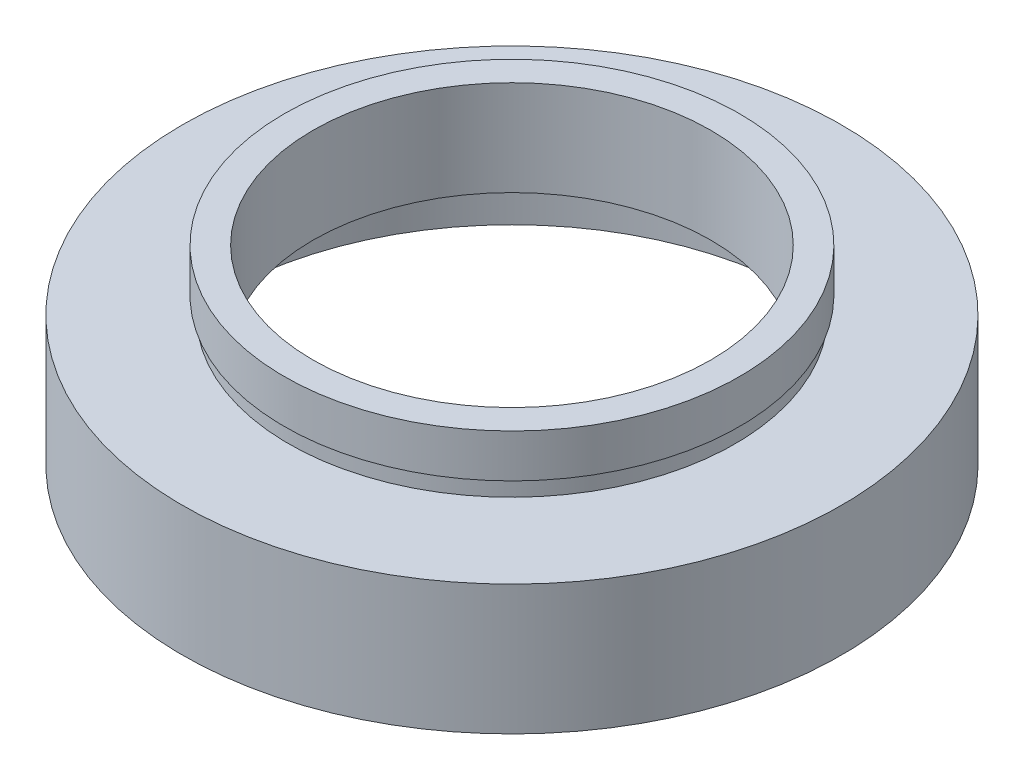
ISO-10303-21;
HEADER;
FILE_DESCRIPTION(('STEP AP214'),'2;1');
FILE_NAME('part.step','',(''),(''),'','','');
FILE_SCHEMA(('AUTOMOTIVE_DESIGN { 1 0 10303 214 1 1 1 1 }'));
ENDSEC;
DATA;
#1=APPLICATION_CONTEXT('core data for automotive mechanical design processes');
#2=APPLICATION_PROTOCOL_DEFINITION('international standard','automotive_design',2000,#1);
#3=PRODUCT_CONTEXT('',#1,'mechanical');
#4=PRODUCT('Part','Part','',(#3));
#5=PRODUCT_RELATED_PRODUCT_CATEGORY('part','',(#4));
#6=PRODUCT_DEFINITION_FORMATION('','',#4);
#7=PRODUCT_DEFINITION_CONTEXT('part definition',#1,'design');
#8=PRODUCT_DEFINITION('design','',#6,#7);
#9=PRODUCT_DEFINITION_SHAPE('','',#8);
#10=(LENGTH_UNIT() NAMED_UNIT(*) SI_UNIT(.MILLI.,.METRE.));
#11=(NAMED_UNIT(*) PLANE_ANGLE_UNIT() SI_UNIT($,.RADIAN.));
#12=(NAMED_UNIT(*) SI_UNIT($,.STERADIAN.) SOLID_ANGLE_UNIT());
#13=UNCERTAINTY_MEASURE_WITH_UNIT(LENGTH_MEASURE(1.E-05),#10,'distance_accuracy_value','');
#14=(GEOMETRIC_REPRESENTATION_CONTEXT(3) GLOBAL_UNCERTAINTY_ASSIGNED_CONTEXT((#13)) GLOBAL_UNIT_ASSIGNED_CONTEXT((#10,
#11,#12)) REPRESENTATION_CONTEXT('',''));
#15=CARTESIAN_POINT('',(0.,0.,0.));
#16=DIRECTION('',(0.,0.,1.));
#17=DIRECTION('',(1.,0.,0.));
#18=AXIS2_PLACEMENT_3D('',#15,#16,#17);
#19=CARTESIAN_POINT('',(19.05,0.,0.));
#20=DIRECTION('',(0.,1.,0.));
#21=DIRECTION('',(-1.,0.,0.));
#22=AXIS2_PLACEMENT_3D('',#19,#20,#21);
#23=PLANE('',#22);
#24=CARTESIAN_POINT('',(0.,0.,0.));
#25=DIRECTION('',(0.,1.,0.));
#26=DIRECTION('',(-1.,0.,0.));
#27=AXIS2_PLACEMENT_3D('',#24,#25,#26);
#28=CIRCLE('',#27,19.05);
#29=CARTESIAN_POINT('',(-19.05,0.,0.));
#30=VERTEX_POINT('',#29);
#31=EDGE_CURVE('E75',#30,#30,#28,.T.);
#32=ORIENTED_EDGE('',*,*,#31,.F.);
#33=EDGE_LOOP('',(#32));
#34=FACE_BOUND('',#33,.T.);
#35=CARTESIAN_POINT('',(0.,0.,0.));
#36=DIRECTION('',(0.,1.,0.));
#37=DIRECTION('',(-1.,0.,0.));
#38=AXIS2_PLACEMENT_3D('',#35,#36,#37);
#39=CIRCLE('',#38,17.);
#40=CARTESIAN_POINT('',(-17.,0.,0.));
#41=VERTEX_POINT('',#40);
#42=EDGE_CURVE('E10',#41,#41,#39,.T.);
#43=ORIENTED_EDGE('',*,*,#42,.T.);
#44=EDGE_LOOP('',(#43));
#45=FACE_BOUND('',#44,.T.);
#46=ADVANCED_FACE('F35',(#34,#45),#23,.F.);
#47=CARTESIAN_POINT('',(0.,16.8860182370821,0.));
#48=DIRECTION('',(0.,1.,0.));
#49=DIRECTION('',(-1.,0.,0.));
#50=AXIS2_PLACEMENT_3D('',#47,#48,#49);
#51=CYLINDRICAL_SURFACE('',#50,17.);
#52=ORIENTED_EDGE('',*,*,#42,.F.);
#53=EDGE_LOOP('',(#52));
#54=FACE_BOUND('',#53,.T.);
#55=CARTESIAN_POINT('',(0.,4.5,0.));
#56=DIRECTION('',(0.,1.,0.));
#57=DIRECTION('',(-1.,0.,0.));
#58=AXIS2_PLACEMENT_3D('',#55,#56,#57);
#59=CIRCLE('',#58,17.);
#60=CARTESIAN_POINT('',(-17.,4.5,0.));
#61=VERTEX_POINT('',#60);
#62=EDGE_CURVE('E41',#61,#61,#59,.T.);
#63=ORIENTED_EDGE('',*,*,#62,.T.);
#64=EDGE_LOOP('',(#63));
#65=FACE_BOUND('',#64,.T.);
#66=ADVANCED_FACE('F82',(#54,#65),#51,.F.);
#67=CARTESIAN_POINT('',(17.,4.5,0.));
#68=DIRECTION('',(0.,-1.,0.));
#69=DIRECTION('',(1.,0.,0.));
#70=AXIS2_PLACEMENT_3D('',#67,#68,#69);
#71=PLANE('',#70);
#72=ORIENTED_EDGE('',*,*,#62,.F.);
#73=EDGE_LOOP('',(#72));
#74=FACE_BOUND('',#73,.T.);
#75=CARTESIAN_POINT('',(0.,4.5,0.));
#76=DIRECTION('',(0.,1.,0.));
#77=DIRECTION('',(-1.,0.,0.));
#78=AXIS2_PLACEMENT_3D('',#75,#76,#77);
#79=CIRCLE('',#78,17.6);
#80=CARTESIAN_POINT('',(-17.6,4.5,0.));
#81=VERTEX_POINT('',#80);
#82=EDGE_CURVE('E45',#81,#81,#79,.T.);
#83=ORIENTED_EDGE('',*,*,#82,.T.);
#84=EDGE_LOOP('',(#83));
#85=FACE_BOUND('',#84,.T.);
#86=ADVANCED_FACE('F86',(#74,#85),#71,.F.);
#87=CARTESIAN_POINT('',(0.,16.8860182370821,0.));
#88=DIRECTION('',(0.,1.,0.));
#89=DIRECTION('',(-1.,0.,0.));
#90=AXIS2_PLACEMENT_3D('',#87,#88,#89);
#91=CYLINDRICAL_SURFACE('',#90,17.6);
#92=ORIENTED_EDGE('',*,*,#82,.F.);
#93=EDGE_LOOP('',(#92));
#94=FACE_BOUND('',#93,.T.);
#95=CARTESIAN_POINT('',(0.,5.5,0.));
#96=DIRECTION('',(0.,1.,0.));
#97=DIRECTION('',(-1.,0.,0.));
#98=AXIS2_PLACEMENT_3D('',#95,#96,#97);
#99=CIRCLE('',#98,17.6);
#100=CARTESIAN_POINT('',(-17.6,5.5,0.));
#101=VERTEX_POINT('',#100);
#102=EDGE_CURVE('E49',#101,#101,#99,.T.);
#103=ORIENTED_EDGE('',*,*,#102,.T.);
#104=EDGE_LOOP('',(#103));
#105=FACE_BOUND('',#104,.T.);
#106=ADVANCED_FACE('F91',(#94,#105),#91,.F.);
#107=CARTESIAN_POINT('',(11.5,5.5,0.));
#108=DIRECTION('',(0.,1.,0.));
#109=DIRECTION('',(-1.,0.,0.));
#110=AXIS2_PLACEMENT_3D('',#107,#108,#109);
#111=PLANE('',#110);
#112=ORIENTED_EDGE('',*,*,#102,.F.);
#113=EDGE_LOOP('',(#112));
#114=FACE_BOUND('',#113,.T.);
#115=CARTESIAN_POINT('',(0.,5.5,0.));
#116=DIRECTION('',(0.,1.,0.));
#117=DIRECTION('',(-1.,0.,0.));
#118=AXIS2_PLACEMENT_3D('',#115,#116,#117);
#119=CIRCLE('',#118,11.5);
#120=CARTESIAN_POINT('',(-11.5,5.5,0.));
#121=VERTEX_POINT('',#120);
#122=EDGE_CURVE('E54',#121,#121,#119,.T.);
#123=ORIENTED_EDGE('',*,*,#122,.T.);
#124=EDGE_LOOP('',(#123));
#125=FACE_BOUND('',#124,.T.);
#126=ADVANCED_FACE('F97',(#114,#125),#111,.F.);
#127=CARTESIAN_POINT('',(0.,16.8860182370821,0.));
#128=DIRECTION('',(0.,1.,0.));
#129=DIRECTION('',(-1.,0.,0.));
#130=AXIS2_PLACEMENT_3D('',#127,#128,#129);
#131=CYLINDRICAL_SURFACE('',#130,11.5);
#132=ORIENTED_EDGE('',*,*,#122,.F.);
#133=EDGE_LOOP('',(#132));
#134=FACE_BOUND('',#133,.T.);
#135=CARTESIAN_POINT('',(0.,11.,0.));
#136=DIRECTION('',(0.,1.,0.));
#137=DIRECTION('',(-1.,0.,0.));
#138=AXIS2_PLACEMENT_3D('',#135,#136,#137);
#139=CIRCLE('',#138,11.5);
#140=CARTESIAN_POINT('',(-11.5,11.,0.));
#141=VERTEX_POINT('',#140);
#142=EDGE_CURVE('E57',#141,#141,#139,.T.);
#143=ORIENTED_EDGE('',*,*,#142,.T.);
#144=EDGE_LOOP('',(#143));
#145=FACE_BOUND('',#144,.T.);
#146=ADVANCED_FACE('F101',(#134,#145),#131,.F.);
#147=CARTESIAN_POINT('',(11.5,11.,0.));
#148=DIRECTION('',(0.,-1.,0.));
#149=DIRECTION('',(1.,0.,0.));
#150=AXIS2_PLACEMENT_3D('',#147,#148,#149);
#151=PLANE('',#150);
#152=ORIENTED_EDGE('',*,*,#142,.F.);
#153=EDGE_LOOP('',(#152));
#154=FACE_BOUND('',#153,.T.);
#155=CARTESIAN_POINT('',(0.,11.,0.));
#156=DIRECTION('',(0.,1.,0.));
#157=DIRECTION('',(-1.,0.,0.));
#158=AXIS2_PLACEMENT_3D('',#155,#156,#157);
#159=CIRCLE('',#158,13.16);
#160=CARTESIAN_POINT('',(-13.16,11.,0.));
#161=VERTEX_POINT('',#160);
#162=EDGE_CURVE('E60',#161,#161,#159,.T.);
#163=ORIENTED_EDGE('',*,*,#162,.T.);
#164=EDGE_LOOP('',(#163));
#165=FACE_BOUND('',#164,.T.);
#166=ADVANCED_FACE('F105',(#154,#165),#151,.F.);
#167=CARTESIAN_POINT('',(0.,16.8860182370821,0.));
#168=DIRECTION('',(0.,1.,0.));
#169=DIRECTION('',(-1.,0.,0.));
#170=AXIS2_PLACEMENT_3D('',#167,#168,#169);
#171=CYLINDRICAL_SURFACE('',#170,13.16);
#172=ORIENTED_EDGE('',*,*,#162,.F.);
#173=EDGE_LOOP('',(#172));
#174=FACE_BOUND('',#173,.T.);
#175=CARTESIAN_POINT('',(0.,8.5,0.));
#176=DIRECTION('',(0.,1.,0.));
#177=DIRECTION('',(-1.,0.,0.));
#178=AXIS2_PLACEMENT_3D('',#175,#176,#177);
#179=CIRCLE('',#178,13.16);
#180=CARTESIAN_POINT('',(-13.16,8.5,0.));
#181=VERTEX_POINT('',#180);
#182=EDGE_CURVE('E63',#181,#181,#179,.T.);
#183=ORIENTED_EDGE('',*,*,#182,.T.);
#184=EDGE_LOOP('',(#183));
#185=FACE_BOUND('',#184,.T.);
#186=ADVANCED_FACE('F109',(#174,#185),#171,.T.);
#187=CARTESIAN_POINT('',(13.16,8.5,0.));
#188=DIRECTION('',(0.,1.,0.));
#189=DIRECTION('',(-1.,0.,0.));
#190=AXIS2_PLACEMENT_3D('',#187,#188,#189);
#191=PLANE('',#190);
#192=ORIENTED_EDGE('',*,*,#182,.F.);
#193=EDGE_LOOP('',(#192));
#194=FACE_BOUND('',#193,.T.);
#195=CARTESIAN_POINT('',(0.,8.5,0.));
#196=DIRECTION('',(0.,1.,0.));
#197=DIRECTION('',(-1.,0.,0.));
#198=AXIS2_PLACEMENT_3D('',#195,#196,#197);
#199=CIRCLE('',#198,12.9);
#200=CARTESIAN_POINT('',(-12.9,8.5,0.));
#201=VERTEX_POINT('',#200);
#202=EDGE_CURVE('E66',#201,#201,#199,.T.);
#203=ORIENTED_EDGE('',*,*,#202,.T.);
#204=EDGE_LOOP('',(#203));
#205=FACE_BOUND('',#204,.T.);
#206=ADVANCED_FACE('F113',(#194,#205),#191,.F.);
#207=CARTESIAN_POINT('',(0.,16.8860182370821,0.));
#208=DIRECTION('',(0.,1.,0.));
#209=DIRECTION('',(-1.,0.,0.));
#210=AXIS2_PLACEMENT_3D('',#207,#208,#209);
#211=CYLINDRICAL_SURFACE('',#210,12.9);
#212=ORIENTED_EDGE('',*,*,#202,.F.);
#213=EDGE_LOOP('',(#212));
#214=FACE_BOUND('',#213,.T.);
#215=CARTESIAN_POINT('',(0.,7.5,0.));
#216=DIRECTION('',(0.,1.,0.));
#217=DIRECTION('',(-1.,0.,0.));
#218=AXIS2_PLACEMENT_3D('',#215,#216,#217);
#219=CIRCLE('',#218,12.9);
#220=CARTESIAN_POINT('',(-12.9,7.5,0.));
#221=VERTEX_POINT('',#220);
#222=EDGE_CURVE('E69',#221,#221,#219,.T.);
#223=ORIENTED_EDGE('',*,*,#222,.T.);
#224=EDGE_LOOP('',(#223));
#225=FACE_BOUND('',#224,.T.);
#226=ADVANCED_FACE('F117',(#214,#225),#211,.T.);
#227=CARTESIAN_POINT('',(12.9,7.5,0.));
#228=DIRECTION('',(0.,-1.,0.));
#229=DIRECTION('',(1.,0.,0.));
#230=AXIS2_PLACEMENT_3D('',#227,#228,#229);
#231=PLANE('',#230);
#232=ORIENTED_EDGE('',*,*,#222,.F.);
#233=EDGE_LOOP('',(#232));
#234=FACE_BOUND('',#233,.T.);
#235=CARTESIAN_POINT('',(0.,7.5,0.));
#236=DIRECTION('',(0.,1.,0.));
#237=DIRECTION('',(-1.,0.,0.));
#238=AXIS2_PLACEMENT_3D('',#235,#236,#237);
#239=CIRCLE('',#238,19.05);
#240=CARTESIAN_POINT('',(-19.05,7.5,0.));
#241=VERTEX_POINT('',#240);
#242=EDGE_CURVE('E72',#241,#241,#239,.T.);
#243=ORIENTED_EDGE('',*,*,#242,.T.);
#244=EDGE_LOOP('',(#243));
#245=FACE_BOUND('',#244,.T.);
#246=ADVANCED_FACE('F121',(#234,#245),#231,.F.);
#247=CARTESIAN_POINT('',(0.,16.8860182370821,0.));
#248=DIRECTION('',(0.,1.,0.));
#249=DIRECTION('',(-1.,0.,0.));
#250=AXIS2_PLACEMENT_3D('',#247,#248,#249);
#251=CYLINDRICAL_SURFACE('',#250,19.05);
#252=ORIENTED_EDGE('',*,*,#242,.F.);
#253=EDGE_LOOP('',(#252));
#254=FACE_BOUND('',#253,.T.);
#255=ORIENTED_EDGE('',*,*,#31,.T.);
#256=EDGE_LOOP('',(#255));
#257=FACE_BOUND('',#256,.T.);
#258=ADVANCED_FACE('F79',(#254,#257),#251,.T.);
#259=CLOSED_SHELL('',(#46,#66,#86,#106,#126,#146,#166,#186,#206,#226,#246,#258));
#260=MANIFOLD_SOLID_BREP('B2',#259);
#261=ADVANCED_BREP_SHAPE_REPRESENTATION('',(#18,#260),#14);
#262=SHAPE_DEFINITION_REPRESENTATION(#9,#261);
ENDSEC;
END-ISO-10303-21;
